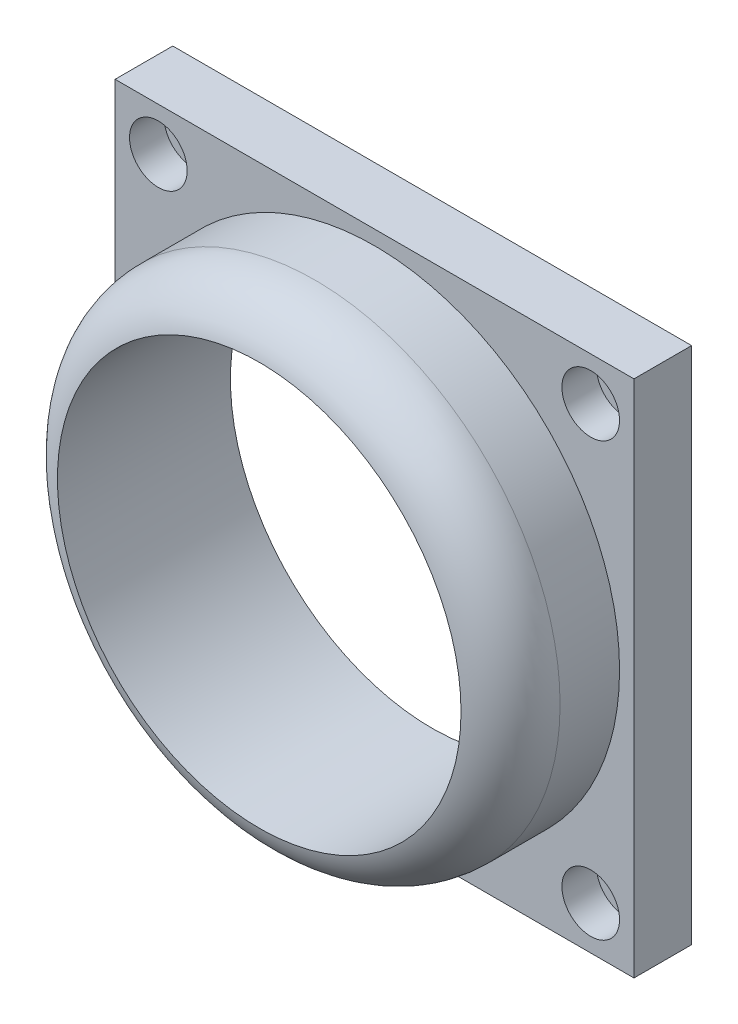
ISO-10303-21;
HEADER;
FILE_DESCRIPTION(('STEP AP214'),'2;1');
FILE_NAME('part.step','',(''),(''),'','','');
FILE_SCHEMA(('AUTOMOTIVE_DESIGN { 1 0 10303 214 1 1 1 1 }'));
ENDSEC;
DATA;
#1=APPLICATION_CONTEXT('core data for automotive mechanical design processes');
#2=APPLICATION_PROTOCOL_DEFINITION('international standard','automotive_design',2000,#1);
#3=PRODUCT_CONTEXT('',#1,'mechanical');
#4=PRODUCT('Part','Part','',(#3));
#5=PRODUCT_RELATED_PRODUCT_CATEGORY('part','',(#4));
#6=PRODUCT_DEFINITION_FORMATION('','',#4);
#7=PRODUCT_DEFINITION_CONTEXT('part definition',#1,'design');
#8=PRODUCT_DEFINITION('design','',#6,#7);
#9=PRODUCT_DEFINITION_SHAPE('','',#8);
#10=(LENGTH_UNIT() NAMED_UNIT(*) SI_UNIT(.MILLI.,.METRE.));
#11=(NAMED_UNIT(*) PLANE_ANGLE_UNIT() SI_UNIT($,.RADIAN.));
#12=(NAMED_UNIT(*) SI_UNIT($,.STERADIAN.) SOLID_ANGLE_UNIT());
#13=UNCERTAINTY_MEASURE_WITH_UNIT(LENGTH_MEASURE(1.E-05),#10,'distance_accuracy_value','');
#14=(GEOMETRIC_REPRESENTATION_CONTEXT(3) GLOBAL_UNCERTAINTY_ASSIGNED_CONTEXT((#13)) GLOBAL_UNIT_ASSIGNED_CONTEXT((#10,
#11,#12)) REPRESENTATION_CONTEXT('',''));
#15=CARTESIAN_POINT('',(0.,0.,0.));
#16=DIRECTION('',(0.,0.,1.));
#17=DIRECTION('',(1.,0.,0.));
#18=AXIS2_PLACEMENT_3D('',#15,#16,#17);
#19=CARTESIAN_POINT('',(-85.2328494019016,65.635926796851,0.));
#20=DIRECTION('',(0.,0.,1.));
#21=DIRECTION('',(1.,0.,0.));
#22=AXIS2_PLACEMENT_3D('',#19,#20,#21);
#23=CYLINDRICAL_SURFACE('',#22,3.00000000000001);
#24=CARTESIAN_POINT('',(-85.2328494019016,65.635926796851,0.));
#25=DIRECTION('',(0.,0.,1.));
#26=DIRECTION('',(1.,0.,0.));
#27=AXIS2_PLACEMENT_3D('',#24,#25,#26);
#28=CIRCLE('',#27,3.00000000000001);
#29=CARTESIAN_POINT('',(-82.2328494019016,65.635926796851,0.));
#30=VERTEX_POINT('',#29);
#31=EDGE_CURVE('E165',#30,#30,#28,.T.);
#32=ORIENTED_EDGE('',*,*,#31,.F.);
#33=EDGE_LOOP('',(#32));
#34=FACE_BOUND('',#33,.T.);
#35=CARTESIAN_POINT('',(-85.2328494019016,65.635926796851,4.));
#36=DIRECTION('',(0.,0.,1.));
#37=DIRECTION('',(1.,0.,0.));
#38=AXIS2_PLACEMENT_3D('',#35,#36,#37);
#39=CIRCLE('',#38,3.00000000000001);
#40=CARTESIAN_POINT('',(-82.2328494019016,65.635926796851,4.));
#41=VERTEX_POINT('',#40);
#42=EDGE_CURVE('E47',#41,#41,#39,.F.);
#43=ORIENTED_EDGE('',*,*,#42,.F.);
#44=EDGE_LOOP('',(#43));
#45=FACE_BOUND('',#44,.T.);
#46=ADVANCED_FACE('F43',(#34,#45),#23,.F.);
#47=CARTESIAN_POINT('',(-10.2328494019017,-9.36407320314899,0.));
#48=DIRECTION('',(0.,0.,1.));
#49=DIRECTION('',(1.,0.,0.));
#50=AXIS2_PLACEMENT_3D('',#47,#48,#49);
#51=CYLINDRICAL_SURFACE('',#50,3.00000000000001);
#52=CARTESIAN_POINT('',(-10.2328494019017,-9.36407320314899,0.));
#53=DIRECTION('',(0.,0.,1.));
#54=DIRECTION('',(1.,0.,0.));
#55=AXIS2_PLACEMENT_3D('',#52,#53,#54);
#56=CIRCLE('',#55,3.00000000000001);
#57=CARTESIAN_POINT('',(-7.23284940190165,-9.36407320314899,0.));
#58=VERTEX_POINT('',#57);
#59=EDGE_CURVE('E155',#58,#58,#56,.T.);
#60=ORIENTED_EDGE('',*,*,#59,.F.);
#61=EDGE_LOOP('',(#60));
#62=FACE_BOUND('',#61,.T.);
#63=CARTESIAN_POINT('',(-10.2328494019017,-9.36407320314899,4.));
#64=DIRECTION('',(0.,0.,1.));
#65=DIRECTION('',(1.,0.,0.));
#66=AXIS2_PLACEMENT_3D('',#63,#64,#65);
#67=CIRCLE('',#66,3.00000000000001);
#68=CARTESIAN_POINT('',(-7.23284940190165,-9.36407320314899,4.));
#69=VERTEX_POINT('',#68);
#70=EDGE_CURVE('E139',#69,#69,#67,.F.);
#71=ORIENTED_EDGE('',*,*,#70,.F.);
#72=EDGE_LOOP('',(#71));
#73=FACE_BOUND('',#72,.T.);
#74=ADVANCED_FACE('F222',(#62,#73),#51,.F.);
#75=CARTESIAN_POINT('',(0.,0.,10.));
#76=DIRECTION('',(0.,0.,1.));
#77=DIRECTION('',(1.,0.,0.));
#78=AXIS2_PLACEMENT_3D('',#75,#76,#77);
#79=PLANE('',#78);
#80=CARTESIAN_POINT('',(-85.2328494019016,-9.36407320314893,10.));
#81=DIRECTION('',(0.,0.,1.));
#82=DIRECTION('',(-1.,0.,0.));
#83=AXIS2_PLACEMENT_3D('',#80,#81,#82);
#84=CIRCLE('',#83,5.00000000000001);
#85=CARTESIAN_POINT('',(-90.2328494019017,-9.36407320314893,10.));
#86=VERTEX_POINT('',#85);
#87=EDGE_CURVE('E197',#86,#86,#84,.T.);
#88=ORIENTED_EDGE('',*,*,#87,.F.);
#89=EDGE_LOOP('',(#88));
#90=FACE_BOUND('',#89,.T.);
#91=CARTESIAN_POINT('',(-10.2328494019016,-9.36407320314893,10.));
#92=DIRECTION('',(0.,0.,1.));
#93=DIRECTION('',(1.,0.,0.));
#94=AXIS2_PLACEMENT_3D('',#91,#92,#93);
#95=CIRCLE('',#94,5.00000000000001);
#96=CARTESIAN_POINT('',(-5.23284940190161,-9.36407320314893,10.));
#97=VERTEX_POINT('',#96);
#98=EDGE_CURVE('E205',#97,#97,#95,.T.);
#99=ORIENTED_EDGE('',*,*,#98,.F.);
#100=EDGE_LOOP('',(#99));
#101=FACE_BOUND('',#100,.T.);
#102=CARTESIAN_POINT('',(-10.2328494019016,65.635926796851,10.));
#103=DIRECTION('',(0.,0.,1.));
#104=DIRECTION('',(-1.,0.,0.));
#105=AXIS2_PLACEMENT_3D('',#102,#103,#104);
#106=CIRCLE('',#105,5.00000000000001);
#107=CARTESIAN_POINT('',(-15.2328494019016,65.635926796851,10.));
#108=VERTEX_POINT('',#107);
#109=EDGE_CURVE('E189',#108,#108,#106,.T.);
#110=ORIENTED_EDGE('',*,*,#109,.F.);
#111=EDGE_LOOP('',(#110));
#112=FACE_BOUND('',#111,.T.);
#113=CARTESIAN_POINT('',(-85.2328494019016,65.635926796851,10.));
#114=DIRECTION('',(0.,0.,1.));
#115=DIRECTION('',(1.,0.,0.));
#116=AXIS2_PLACEMENT_3D('',#113,#114,#115);
#117=CIRCLE('',#116,5.00000000000001);
#118=CARTESIAN_POINT('',(-80.2328494019016,65.635926796851,10.));
#119=VERTEX_POINT('',#118);
#120=EDGE_CURVE('E185',#119,#119,#117,.T.);
#121=ORIENTED_EDGE('',*,*,#120,.F.);
#122=EDGE_LOOP('',(#121));
#123=FACE_BOUND('',#122,.T.);
#124=DIRECTION('',(0.,1.,0.));
#125=VECTOR('',#124,1.);
#126=CARTESIAN_POINT('',(-2.73284940190164,73.135926796851,10.));
#127=LINE('',#126,#125);
#128=CARTESIAN_POINT('',(-2.73284940190163,-16.864073203149,10.));
#129=VERTEX_POINT('',#128);
#130=CARTESIAN_POINT('',(-2.73284940190164,73.135926796851,10.));
#131=VERTEX_POINT('',#130);
#132=EDGE_CURVE('E100',#129,#131,#127,.T.);
#133=ORIENTED_EDGE('',*,*,#132,.T.);
#134=DIRECTION('',(-1.,0.,0.));
#135=VECTOR('',#134,1.);
#136=CARTESIAN_POINT('',(-92.7328494019016,73.135926796851,10.));
#137=LINE('',#136,#135);
#138=CARTESIAN_POINT('',(-92.7328494019016,73.135926796851,10.));
#139=VERTEX_POINT('',#138);
#140=EDGE_CURVE('E94',#131,#139,#137,.T.);
#141=ORIENTED_EDGE('',*,*,#140,.T.);
#142=DIRECTION('',(0.,-1.,0.));
#143=VECTOR('',#142,1.);
#144=CARTESIAN_POINT('',(-92.7328494019016,73.135926796851,10.));
#145=LINE('',#144,#143);
#146=CARTESIAN_POINT('',(-92.7328494019016,-16.864073203149,10.));
#147=VERTEX_POINT('',#146);
#148=EDGE_CURVE('E98',#139,#147,#145,.T.);
#149=ORIENTED_EDGE('',*,*,#148,.T.);
#150=DIRECTION('',(1.,0.,0.));
#151=VECTOR('',#150,1.);
#152=CARTESIAN_POINT('',(-92.7328494019016,-16.864073203149,10.));
#153=LINE('',#152,#151);
#154=EDGE_CURVE('E63',#147,#129,#153,.T.);
#155=ORIENTED_EDGE('',*,*,#154,.T.);
#156=EDGE_LOOP('',(#133,#141,#149,#155));
#157=FACE_BOUND('',#156,.T.);
#158=CARTESIAN_POINT('',(-47.7328494019016,28.135926796851,10.));
#159=DIRECTION('',(0.,0.,1.));
#160=DIRECTION('',(1.,0.,0.));
#161=AXIS2_PLACEMENT_3D('',#158,#159,#160);
#162=CIRCLE('',#161,42.5);
#163=CARTESIAN_POINT('',(-5.23284940190162,28.135926796851,10.));
#164=VERTEX_POINT('',#163);
#165=EDGE_CURVE('E173',#164,#164,#162,.T.);
#166=ORIENTED_EDGE('',*,*,#165,.F.);
#167=EDGE_LOOP('',(#166));
#168=FACE_BOUND('',#167,.T.);
#169=ADVANCED_FACE('F95',(#90,#101,#112,#123,#157,#168),#79,.T.);
#170=CARTESIAN_POINT('',(-2.73284940190164,73.135926796851,10.));
#171=DIRECTION('',(-1.,0.,0.));
#172=DIRECTION('',(0.,-1.,0.));
#173=AXIS2_PLACEMENT_3D('',#170,#171,#172);
#174=PLANE('',#173);
#175=DIRECTION('',(0.,1.,0.));
#176=VECTOR('',#175,1.);
#177=CARTESIAN_POINT('',(-2.73284940190164,73.135926796851,0.));
#178=LINE('',#177,#176);
#179=CARTESIAN_POINT('',(-2.73284940190163,-16.864073203149,0.));
#180=VERTEX_POINT('',#179);
#181=CARTESIAN_POINT('',(-2.73284940190164,73.135926796851,0.));
#182=VERTEX_POINT('',#181);
#183=EDGE_CURVE('E118',#180,#182,#178,.T.);
#184=ORIENTED_EDGE('',*,*,#183,.T.);
#185=DIRECTION('',(0.,0.,-1.));
#186=VECTOR('',#185,1.);
#187=CARTESIAN_POINT('',(-2.73284940190164,73.135926796851,10.));
#188=LINE('',#187,#186);
#189=EDGE_CURVE('E54',#131,#182,#188,.T.);
#190=ORIENTED_EDGE('',*,*,#189,.F.);
#191=ORIENTED_EDGE('',*,*,#132,.F.);
#192=DIRECTION('',(0.,0.,-1.));
#193=VECTOR('',#192,1.);
#194=CARTESIAN_POINT('',(-2.73284940190163,-16.864073203149,10.));
#195=LINE('',#194,#193);
#196=EDGE_CURVE('E114',#129,#180,#195,.T.);
#197=ORIENTED_EDGE('',*,*,#196,.T.);
#198=EDGE_LOOP('',(#184,#190,#191,#197));
#199=FACE_BOUND('',#198,.T.);
#200=ADVANCED_FACE('F221',(#199),#174,.F.);
#201=CARTESIAN_POINT('',(-92.7328494019016,73.135926796851,10.));
#202=DIRECTION('',(0.,-1.,0.));
#203=DIRECTION('',(0.,0.,-1.));
#204=AXIS2_PLACEMENT_3D('',#201,#202,#203);
#205=PLANE('',#204);
#206=DIRECTION('',(-1.,0.,0.));
#207=VECTOR('',#206,1.);
#208=CARTESIAN_POINT('',(-92.7328494019016,73.135926796851,0.));
#209=LINE('',#208,#207);
#210=CARTESIAN_POINT('',(-92.7328494019016,73.135926796851,0.));
#211=VERTEX_POINT('',#210);
#212=EDGE_CURVE('E106',#182,#211,#209,.T.);
#213=ORIENTED_EDGE('',*,*,#212,.T.);
#214=DIRECTION('',(0.,0.,-1.));
#215=VECTOR('',#214,1.);
#216=CARTESIAN_POINT('',(-92.7328494019016,73.135926796851,10.));
#217=LINE('',#216,#215);
#218=EDGE_CURVE('E104',#139,#211,#217,.T.);
#219=ORIENTED_EDGE('',*,*,#218,.F.);
#220=ORIENTED_EDGE('',*,*,#140,.F.);
#221=ORIENTED_EDGE('',*,*,#189,.T.);
#222=EDGE_LOOP('',(#213,#219,#220,#221));
#223=FACE_BOUND('',#222,.T.);
#224=ADVANCED_FACE('F105',(#223),#205,.F.);
#225=CARTESIAN_POINT('',(-92.7328494019016,73.135926796851,10.));
#226=DIRECTION('',(1.,0.,0.));
#227=DIRECTION('',(0.,1.,0.));
#228=AXIS2_PLACEMENT_3D('',#225,#226,#227);
#229=PLANE('',#228);
#230=DIRECTION('',(0.,-1.,0.));
#231=VECTOR('',#230,1.);
#232=CARTESIAN_POINT('',(-92.7328494019016,73.135926796851,0.));
#233=LINE('',#232,#231);
#234=CARTESIAN_POINT('',(-92.7328494019016,-16.864073203149,0.));
#235=VERTEX_POINT('',#234);
#236=EDGE_CURVE('E80',#211,#235,#233,.T.);
#237=ORIENTED_EDGE('',*,*,#236,.T.);
#238=DIRECTION('',(0.,0.,-1.));
#239=VECTOR('',#238,1.);
#240=CARTESIAN_POINT('',(-92.7328494019016,-16.864073203149,10.));
#241=LINE('',#240,#239);
#242=EDGE_CURVE('E108',#147,#235,#241,.T.);
#243=ORIENTED_EDGE('',*,*,#242,.F.);
#244=ORIENTED_EDGE('',*,*,#148,.F.);
#245=ORIENTED_EDGE('',*,*,#218,.T.);
#246=EDGE_LOOP('',(#237,#243,#244,#245));
#247=FACE_BOUND('',#246,.T.);
#248=ADVANCED_FACE('F110',(#247),#229,.F.);
#249=CARTESIAN_POINT('',(-92.7328494019016,-16.864073203149,10.));
#250=DIRECTION('',(0.,1.,0.));
#251=DIRECTION('',(0.,0.,1.));
#252=AXIS2_PLACEMENT_3D('',#249,#250,#251);
#253=PLANE('',#252);
#254=DIRECTION('',(1.,0.,0.));
#255=VECTOR('',#254,1.);
#256=CARTESIAN_POINT('',(-92.7328494019016,-16.864073203149,0.));
#257=LINE('',#256,#255);
#258=EDGE_CURVE('E86',#235,#180,#257,.T.);
#259=ORIENTED_EDGE('',*,*,#258,.T.);
#260=ORIENTED_EDGE('',*,*,#196,.F.);
#261=ORIENTED_EDGE('',*,*,#154,.F.);
#262=ORIENTED_EDGE('',*,*,#242,.T.);
#263=EDGE_LOOP('',(#259,#260,#261,#262));
#264=FACE_BOUND('',#263,.T.);
#265=ADVANCED_FACE('F263',(#264),#253,.F.);
#266=CARTESIAN_POINT('',(0.,0.,0.));
#267=DIRECTION('',(0.,0.,1.));
#268=DIRECTION('',(1.,0.,0.));
#269=AXIS2_PLACEMENT_3D('',#266,#267,#268);
#270=PLANE('',#269);
#271=CARTESIAN_POINT('',(-85.2328494019017,-9.36407320314897,0.));
#272=DIRECTION('',(0.,0.,1.));
#273=DIRECTION('',(-1.,0.,0.));
#274=AXIS2_PLACEMENT_3D('',#271,#272,#273);
#275=CIRCLE('',#274,3.00000000000001);
#276=CARTESIAN_POINT('',(-88.2328494019017,-9.36407320314897,0.));
#277=VERTEX_POINT('',#276);
#278=EDGE_CURVE('E150',#277,#277,#275,.T.);
#279=ORIENTED_EDGE('',*,*,#278,.T.);
#280=EDGE_LOOP('',(#279));
#281=FACE_BOUND('',#280,.T.);
#282=ORIENTED_EDGE('',*,*,#59,.T.);
#283=EDGE_LOOP('',(#282));
#284=FACE_BOUND('',#283,.T.);
#285=CARTESIAN_POINT('',(-10.2328494019017,65.635926796851,0.));
#286=DIRECTION('',(0.,0.,1.));
#287=DIRECTION('',(-1.,0.,0.));
#288=AXIS2_PLACEMENT_3D('',#285,#286,#287);
#289=CIRCLE('',#288,3.00000000000001);
#290=CARTESIAN_POINT('',(-13.2328494019017,65.635926796851,0.));
#291=VERTEX_POINT('',#290);
#292=EDGE_CURVE('E161',#291,#291,#289,.T.);
#293=ORIENTED_EDGE('',*,*,#292,.T.);
#294=EDGE_LOOP('',(#293));
#295=FACE_BOUND('',#294,.T.);
#296=ORIENTED_EDGE('',*,*,#31,.T.);
#297=EDGE_LOOP('',(#296));
#298=FACE_BOUND('',#297,.T.);
#299=CARTESIAN_POINT('',(-47.7328494019016,28.135926796851,0.));
#300=DIRECTION('',(0.,0.,1.));
#301=DIRECTION('',(1.,0.,0.));
#302=AXIS2_PLACEMENT_3D('',#299,#300,#301);
#303=CIRCLE('',#302,35.);
#304=CARTESIAN_POINT('',(-12.7328494019016,28.135926796851,0.));
#305=VERTEX_POINT('',#304);
#306=EDGE_CURVE('E122',#305,#305,#303,.T.);
#307=ORIENTED_EDGE('',*,*,#306,.T.);
#308=EDGE_LOOP('',(#307));
#309=FACE_BOUND('',#308,.T.);
#310=ORIENTED_EDGE('',*,*,#183,.F.);
#311=ORIENTED_EDGE('',*,*,#258,.F.);
#312=ORIENTED_EDGE('',*,*,#236,.F.);
#313=ORIENTED_EDGE('',*,*,#212,.F.);
#314=EDGE_LOOP('',(#310,#311,#312,#313));
#315=FACE_BOUND('',#314,.T.);
#316=ADVANCED_FACE('F258',(#281,#284,#295,#298,#309,#315),#270,.F.);
#317=CARTESIAN_POINT('',(-47.7328494019016,28.135926796851,0.));
#318=DIRECTION('',(0.,0.,1.));
#319=DIRECTION('',(1.,0.,0.));
#320=AXIS2_PLACEMENT_3D('',#317,#318,#319);
#321=CYLINDRICAL_SURFACE('',#320,35.);
#322=ORIENTED_EDGE('',*,*,#306,.F.);
#323=EDGE_LOOP('',(#322));
#324=FACE_BOUND('',#323,.T.);
#325=CARTESIAN_POINT('',(-47.7328494019016,28.135926796851,30.));
#326=DIRECTION('',(0.,0.,1.));
#327=DIRECTION('',(1.,0.,0.));
#328=AXIS2_PLACEMENT_3D('',#325,#326,#327);
#329=CIRCLE('',#328,35.);
#330=CARTESIAN_POINT('',(-12.7328494019016,28.135926796851,30.));
#331=VERTEX_POINT('',#330);
#332=EDGE_CURVE('E169',#331,#331,#329,.T.);
#333=ORIENTED_EDGE('',*,*,#332,.T.);
#334=EDGE_LOOP('',(#333));
#335=FACE_BOUND('',#334,.T.);
#336=ADVANCED_FACE('F255',(#324,#335),#321,.F.);
#337=CARTESIAN_POINT('',(-47.7328494019016,28.135926796851,30.));
#338=DIRECTION('',(0.,0.,-1.));
#339=DIRECTION('',(-1.,0.,0.));
#340=AXIS2_PLACEMENT_3D('',#337,#338,#339);
#341=CYLINDRICAL_SURFACE('',#340,42.5);
#342=CARTESIAN_POINT('',(-47.7328494019016,28.135926796851,20.3175416344815));
#343=DIRECTION('',(0.,0.,1.));
#344=DIRECTION('',(1.,0.,0.));
#345=AXIS2_PLACEMENT_3D('',#342,#343,#344);
#346=CIRCLE('',#345,42.5);
#347=CARTESIAN_POINT('',(-5.23284940190162,28.135926796851,20.3175416344815));
#348=VERTEX_POINT('',#347);
#349=EDGE_CURVE('E11',#348,#348,#346,.F.);
#350=ORIENTED_EDGE('',*,*,#349,.T.);
#351=EDGE_LOOP('',(#350));
#352=FACE_BOUND('',#351,.T.);
#353=ORIENTED_EDGE('',*,*,#165,.T.);
#354=EDGE_LOOP('',(#353));
#355=FACE_BOUND('',#354,.T.);
#356=ADVANCED_FACE('F252',(#352,#355),#341,.T.);
#357=CARTESIAN_POINT('',(-47.7328494019016,28.135926796851,20.3175416344815));
#358=DIRECTION('',(0.,0.,1.));
#359=DIRECTION('',(1.,0.,0.));
#360=AXIS2_PLACEMENT_3D('',#357,#358,#359);
#361=TOROIDAL_SURFACE('',#360,32.5,10.);
#362=ORIENTED_EDGE('',*,*,#349,.F.);
#363=EDGE_LOOP('',(#362));
#364=FACE_BOUND('',#363,.T.);
#365=ORIENTED_EDGE('',*,*,#332,.F.);
#366=EDGE_LOOP('',(#365));
#367=FACE_BOUND('',#366,.T.);
#368=ADVANCED_FACE('F45',(#364,#367),#361,.T.);
#369=CARTESIAN_POINT('',(-10.2328494019017,65.635926796851,0.));
#370=DIRECTION('',(0.,0.,1.));
#371=DIRECTION('',(1.,0.,0.));
#372=AXIS2_PLACEMENT_3D('',#369,#370,#371);
#373=CYLINDRICAL_SURFACE('',#372,3.00000000000001);
#374=CARTESIAN_POINT('',(-10.2328494019017,65.635926796851,4.));
#375=DIRECTION('',(0.,0.,-1.));
#376=DIRECTION('',(-1.,0.,0.));
#377=AXIS2_PLACEMENT_3D('',#374,#375,#376);
#378=CIRCLE('',#377,3.00000000000001);
#379=CARTESIAN_POINT('',(-13.2328494019017,65.635926796851,4.));
#380=VERTEX_POINT('',#379);
#381=EDGE_CURVE('E143',#380,#380,#378,.F.);
#382=ORIENTED_EDGE('',*,*,#381,.T.);
#383=EDGE_LOOP('',(#382));
#384=FACE_BOUND('',#383,.T.);
#385=ORIENTED_EDGE('',*,*,#292,.F.);
#386=EDGE_LOOP('',(#385));
#387=FACE_BOUND('',#386,.T.);
#388=ADVANCED_FACE('F307',(#384,#387),#373,.F.);
#389=CARTESIAN_POINT('',(-85.2328494019017,-9.36407320314897,0.));
#390=DIRECTION('',(0.,0.,1.));
#391=DIRECTION('',(1.,0.,0.));
#392=AXIS2_PLACEMENT_3D('',#389,#390,#391);
#393=CYLINDRICAL_SURFACE('',#392,3.00000000000001);
#394=CARTESIAN_POINT('',(-85.2328494019017,-9.36407320314897,4.));
#395=DIRECTION('',(0.,0.,-1.));
#396=DIRECTION('',(-1.,0.,0.));
#397=AXIS2_PLACEMENT_3D('',#394,#395,#396);
#398=CIRCLE('',#397,3.00000000000001);
#399=CARTESIAN_POINT('',(-88.2328494019017,-9.36407320314897,4.));
#400=VERTEX_POINT('',#399);
#401=EDGE_CURVE('E135',#400,#400,#398,.F.);
#402=ORIENTED_EDGE('',*,*,#401,.T.);
#403=EDGE_LOOP('',(#402));
#404=FACE_BOUND('',#403,.T.);
#405=ORIENTED_EDGE('',*,*,#278,.F.);
#406=EDGE_LOOP('',(#405));
#407=FACE_BOUND('',#406,.T.);
#408=ADVANCED_FACE('F251',(#404,#407),#393,.F.);
#409=CARTESIAN_POINT('',(-85.2328494019016,-9.36407320314893,4.));
#410=DIRECTION('',(0.,0.,-1.));
#411=DIRECTION('',(-1.,0.,0.));
#412=AXIS2_PLACEMENT_3D('',#409,#410,#411);
#413=PLANE('',#412);
#414=CARTESIAN_POINT('',(-85.2328494019016,-9.36407320314893,4.));
#415=DIRECTION('',(0.,0.,1.));
#416=DIRECTION('',(-1.,0.,0.));
#417=AXIS2_PLACEMENT_3D('',#414,#415,#416);
#418=CIRCLE('',#417,5.00000000000001);
#419=CARTESIAN_POINT('',(-90.2328494019017,-9.36407320314893,4.));
#420=VERTEX_POINT('',#419);
#421=EDGE_CURVE('E193',#420,#420,#418,.T.);
#422=ORIENTED_EDGE('',*,*,#421,.T.);
#423=EDGE_LOOP('',(#422));
#424=FACE_BOUND('',#423,.T.);
#425=ORIENTED_EDGE('',*,*,#401,.F.);
#426=EDGE_LOOP('',(#425));
#427=FACE_BOUND('',#426,.T.);
#428=ADVANCED_FACE('F319',(#424,#427),#413,.F.);
#429=CARTESIAN_POINT('',(-85.2328494019016,-9.36407320314893,4.));
#430=DIRECTION('',(0.,0.,1.));
#431=DIRECTION('',(1.,0.,0.));
#432=AXIS2_PLACEMENT_3D('',#429,#430,#431);
#433=CYLINDRICAL_SURFACE('',#432,5.00000000000001);
#434=ORIENTED_EDGE('',*,*,#421,.F.);
#435=EDGE_LOOP('',(#434));
#436=FACE_BOUND('',#435,.T.);
#437=ORIENTED_EDGE('',*,*,#87,.T.);
#438=EDGE_LOOP('',(#437));
#439=FACE_BOUND('',#438,.T.);
#440=ADVANCED_FACE('F326',(#436,#439),#433,.F.);
#441=CARTESIAN_POINT('',(-10.2328494019016,-9.36407320314893,4.));
#442=DIRECTION('',(0.,0.,1.));
#443=DIRECTION('',(1.,0.,0.));
#444=AXIS2_PLACEMENT_3D('',#441,#442,#443);
#445=PLANE('',#444);
#446=CARTESIAN_POINT('',(-10.2328494019016,-9.36407320314893,4.));
#447=DIRECTION('',(0.,0.,1.));
#448=DIRECTION('',(1.,0.,0.));
#449=AXIS2_PLACEMENT_3D('',#446,#447,#448);
#450=CIRCLE('',#449,5.00000000000001);
#451=CARTESIAN_POINT('',(-5.23284940190161,-9.36407320314893,4.));
#452=VERTEX_POINT('',#451);
#453=EDGE_CURVE('E201',#452,#452,#450,.T.);
#454=ORIENTED_EDGE('',*,*,#453,.T.);
#455=EDGE_LOOP('',(#454));
#456=FACE_BOUND('',#455,.T.);
#457=ORIENTED_EDGE('',*,*,#70,.T.);
#458=EDGE_LOOP('',(#457));
#459=FACE_BOUND('',#458,.T.);
#460=ADVANCED_FACE('F334',(#456,#459),#445,.T.);
#461=CARTESIAN_POINT('',(-10.2328494019016,-9.36407320314893,4.));
#462=DIRECTION('',(0.,0.,1.));
#463=DIRECTION('',(1.,0.,0.));
#464=AXIS2_PLACEMENT_3D('',#461,#462,#463);
#465=CYLINDRICAL_SURFACE('',#464,5.00000000000001);
#466=ORIENTED_EDGE('',*,*,#453,.F.);
#467=EDGE_LOOP('',(#466));
#468=FACE_BOUND('',#467,.T.);
#469=ORIENTED_EDGE('',*,*,#98,.T.);
#470=EDGE_LOOP('',(#469));
#471=FACE_BOUND('',#470,.T.);
#472=ADVANCED_FACE('F342',(#468,#471),#465,.F.);
#473=CARTESIAN_POINT('',(-10.2328494019016,65.635926796851,4.));
#474=DIRECTION('',(0.,0.,-1.));
#475=DIRECTION('',(-1.,0.,0.));
#476=AXIS2_PLACEMENT_3D('',#473,#474,#475);
#477=PLANE('',#476);
#478=CARTESIAN_POINT('',(-10.2328494019016,65.635926796851,4.));
#479=DIRECTION('',(0.,0.,1.));
#480=DIRECTION('',(-1.,0.,0.));
#481=AXIS2_PLACEMENT_3D('',#478,#479,#480);
#482=CIRCLE('',#481,5.00000000000001);
#483=CARTESIAN_POINT('',(-15.2328494019016,65.635926796851,4.));
#484=VERTEX_POINT('',#483);
#485=EDGE_CURVE('E209',#484,#484,#482,.T.);
#486=ORIENTED_EDGE('',*,*,#485,.T.);
#487=EDGE_LOOP('',(#486));
#488=FACE_BOUND('',#487,.T.);
#489=ORIENTED_EDGE('',*,*,#381,.F.);
#490=EDGE_LOOP('',(#489));
#491=FACE_BOUND('',#490,.T.);
#492=ADVANCED_FACE('F350',(#488,#491),#477,.F.);
#493=CARTESIAN_POINT('',(-10.2328494019016,65.635926796851,4.));
#494=DIRECTION('',(0.,0.,1.));
#495=DIRECTION('',(1.,0.,0.));
#496=AXIS2_PLACEMENT_3D('',#493,#494,#495);
#497=CYLINDRICAL_SURFACE('',#496,5.00000000000001);
#498=ORIENTED_EDGE('',*,*,#485,.F.);
#499=EDGE_LOOP('',(#498));
#500=FACE_BOUND('',#499,.T.);
#501=ORIENTED_EDGE('',*,*,#109,.T.);
#502=EDGE_LOOP('',(#501));
#503=FACE_BOUND('',#502,.T.);
#504=ADVANCED_FACE('F217',(#500,#503),#497,.F.);
#505=CARTESIAN_POINT('',(-85.2328494019016,65.635926796851,4.));
#506=DIRECTION('',(0.,0.,1.));
#507=DIRECTION('',(1.,0.,0.));
#508=AXIS2_PLACEMENT_3D('',#505,#506,#507);
#509=PLANE('',#508);
#510=CARTESIAN_POINT('',(-85.2328494019016,65.635926796851,4.));
#511=DIRECTION('',(0.,0.,1.));
#512=DIRECTION('',(1.,0.,0.));
#513=AXIS2_PLACEMENT_3D('',#510,#511,#512);
#514=CIRCLE('',#513,5.00000000000001);
#515=CARTESIAN_POINT('',(-80.2328494019016,65.635926796851,4.));
#516=VERTEX_POINT('',#515);
#517=EDGE_CURVE('E140',#516,#516,#514,.T.);
#518=ORIENTED_EDGE('',*,*,#517,.T.);
#519=EDGE_LOOP('',(#518));
#520=FACE_BOUND('',#519,.T.);
#521=ORIENTED_EDGE('',*,*,#42,.T.);
#522=EDGE_LOOP('',(#521));
#523=FACE_BOUND('',#522,.T.);
#524=ADVANCED_FACE('F229',(#520,#523),#509,.T.);
#525=CARTESIAN_POINT('',(-85.2328494019016,65.635926796851,4.));
#526=DIRECTION('',(0.,0.,1.));
#527=DIRECTION('',(1.,0.,0.));
#528=AXIS2_PLACEMENT_3D('',#525,#526,#527);
#529=CYLINDRICAL_SURFACE('',#528,5.00000000000001);
#530=ORIENTED_EDGE('',*,*,#517,.F.);
#531=EDGE_LOOP('',(#530));
#532=FACE_BOUND('',#531,.T.);
#533=ORIENTED_EDGE('',*,*,#120,.T.);
#534=EDGE_LOOP('',(#533));
#535=FACE_BOUND('',#534,.T.);
#536=ADVANCED_FACE('F227',(#532,#535),#529,.F.);
#537=CLOSED_SHELL('',(#46,#74,#169,#200,#224,#248,#265,#316,#336,#356,#368,#388,#408,#428,#440,
#460,#472,#492,#504,#524,#536));
#538=MANIFOLD_SOLID_BREP('B2',#537);
#539=ADVANCED_BREP_SHAPE_REPRESENTATION('',(#18,#538),#14);
#540=SHAPE_DEFINITION_REPRESENTATION(#9,#539);
ENDSEC;
END-ISO-10303-21;
